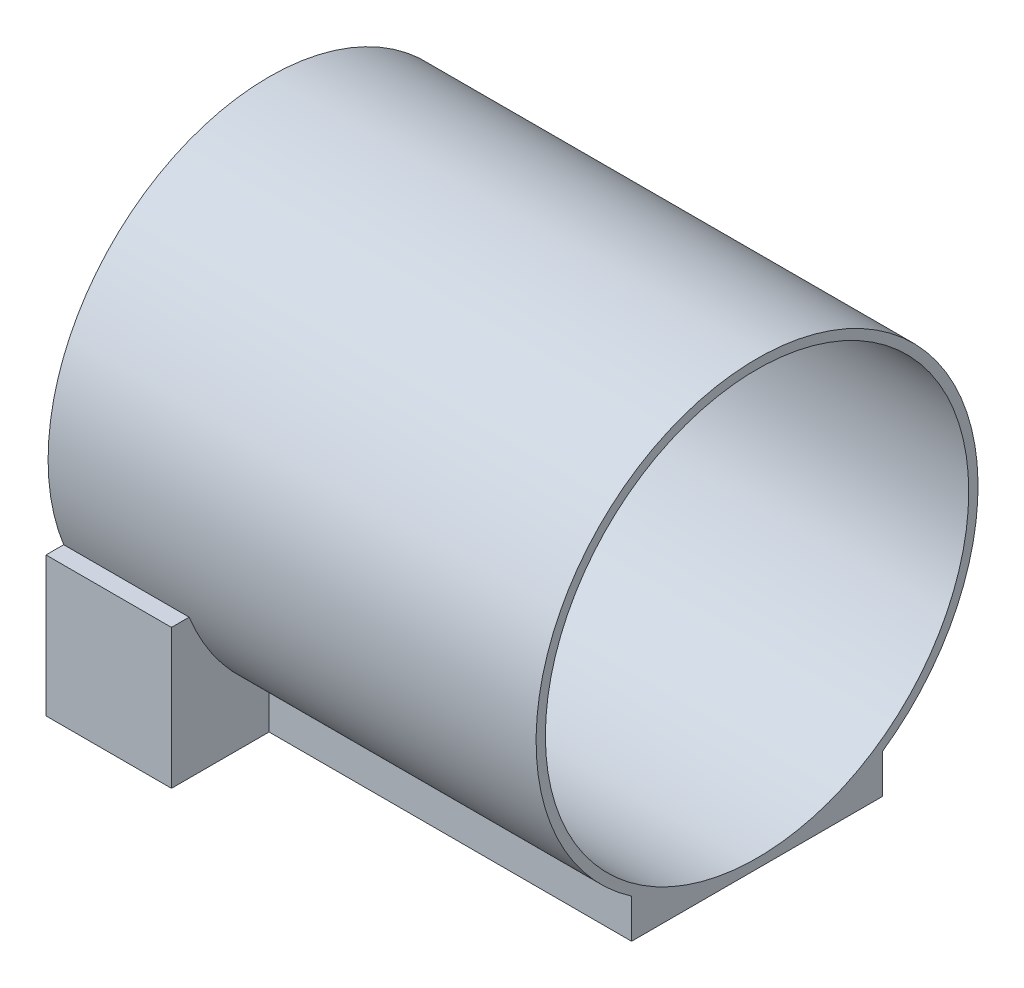
ISO-10303-21;
HEADER;
FILE_DESCRIPTION(('STEP AP214'),'2;1');
FILE_NAME('part.step','',(''),(''),'','','');
FILE_SCHEMA(('AUTOMOTIVE_DESIGN { 1 0 10303 214 1 1 1 1 }'));
ENDSEC;
DATA;
#1=APPLICATION_CONTEXT('core data for automotive mechanical design processes');
#2=APPLICATION_PROTOCOL_DEFINITION('international standard','automotive_design',2000,#1);
#3=PRODUCT_CONTEXT('',#1,'mechanical');
#4=PRODUCT('Part','Part','',(#3));
#5=PRODUCT_RELATED_PRODUCT_CATEGORY('part','',(#4));
#6=PRODUCT_DEFINITION_FORMATION('','',#4);
#7=PRODUCT_DEFINITION_CONTEXT('part definition',#1,'design');
#8=PRODUCT_DEFINITION('design','',#6,#7);
#9=PRODUCT_DEFINITION_SHAPE('','',#8);
#10=(LENGTH_UNIT() NAMED_UNIT(*) SI_UNIT(.MILLI.,.METRE.));
#11=(NAMED_UNIT(*) PLANE_ANGLE_UNIT() SI_UNIT($,.RADIAN.));
#12=(NAMED_UNIT(*) SI_UNIT($,.STERADIAN.) SOLID_ANGLE_UNIT());
#13=UNCERTAINTY_MEASURE_WITH_UNIT(LENGTH_MEASURE(1.E-05),#10,'distance_accuracy_value','');
#14=(GEOMETRIC_REPRESENTATION_CONTEXT(3) GLOBAL_UNCERTAINTY_ASSIGNED_CONTEXT((#13)) GLOBAL_UNIT_ASSIGNED_CONTEXT((#10,
#11,#12)) REPRESENTATION_CONTEXT('',''));
#15=CARTESIAN_POINT('',(0.,0.,0.));
#16=DIRECTION('',(0.,0.,1.));
#17=DIRECTION('',(1.,0.,0.));
#18=AXIS2_PLACEMENT_3D('',#15,#16,#17);
#19=CARTESIAN_POINT('',(-105.,10.,43.));
#20=DIRECTION('',(-1.,0.,0.));
#21=DIRECTION('',(0.,0.,1.));
#22=AXIS2_PLACEMENT_3D('',#19,#20,#21);
#23=PLANE('',#22);
#24=DIRECTION('',(0.,0.,-1.));
#25=VECTOR('',#24,1.);
#26=CARTESIAN_POINT('',(-105.,33.,43.));
#27=LINE('',#26,#25);
#28=CARTESIAN_POINT('',(-105.,33.,-24.5529396832897));
#29=VERTEX_POINT('',#28);
#30=CARTESIAN_POINT('',(-105.,33.,-43.));
#31=VERTEX_POINT('',#30);
#32=EDGE_CURVE('E78',#29,#31,#27,.T.);
#33=ORIENTED_EDGE('',*,*,#32,.F.);
#34=DIRECTION('',(0.,-1.,0.));
#35=VECTOR('',#34,1.);
#36=CARTESIAN_POINT('',(-105.,63.,-24.5529396832897));
#37=LINE('',#36,#35);
#38=CARTESIAN_POINT('',(-105.,42.1839257558356,-24.5529396832897));
#39=VERTEX_POINT('',#38);
#40=EDGE_CURVE('E203',#39,#29,#37,.T.);
#41=ORIENTED_EDGE('',*,*,#40,.F.);
#42=CARTESIAN_POINT('',(-105.,80.55,0.));
#43=DIRECTION('',(-1.,0.,0.));
#44=DIRECTION('',(0.,0.,1.));
#45=AXIS2_PLACEMENT_3D('',#42,#43,#44);
#46=CIRCLE('',#45,45.55);
#47=CARTESIAN_POINT('',(-105.,62.212018017427,-41.6955743071951));
#48=VERTEX_POINT('',#47);
#49=EDGE_CURVE('E171',#48,#39,#46,.T.);
#50=ORIENTED_EDGE('',*,*,#49,.F.);
#51=DIRECTION('',(0.,0.,-1.));
#52=VECTOR('',#51,1.);
#53=CARTESIAN_POINT('',(-105.,62.212018017427,-24.5529396832897));
#54=LINE('',#53,#52);
#55=CARTESIAN_POINT('',(-105.,62.212018017427,-41.8716413735209));
#56=VERTEX_POINT('',#55);
#57=EDGE_CURVE('E258',#48,#56,#54,.T.);
#58=ORIENTED_EDGE('',*,*,#57,.T.);
#59=DIRECTION('',(0.,0.99738967117498,0.0722069514206513));
#60=VECTOR('',#59,1.);
#61=CARTESIAN_POINT('',(-105.,46.6260776434145,-43.));
#62=LINE('',#61,#60);
#63=CARTESIAN_POINT('',(-105.,46.6260776434142,-43.));
#64=VERTEX_POINT('',#63);
#65=EDGE_CURVE('E178',#64,#56,#62,.T.);
#66=ORIENTED_EDGE('',*,*,#65,.F.);
#67=DIRECTION('',(0.,-1.,0.));
#68=VECTOR('',#67,1.);
#69=CARTESIAN_POINT('',(-105.,63.,-43.));
#70=LINE('',#69,#68);
#71=EDGE_CURVE('E261',#64,#31,#70,.T.);
#72=ORIENTED_EDGE('',*,*,#71,.T.);
#73=EDGE_LOOP('',(#33,#41,#50,#58,#66,#72));
#74=FACE_BOUND('',#73,.T.);
#75=ADVANCED_FACE('F67',(#74),#23,.T.);
#76=CARTESIAN_POINT('',(-115.,10.,43.));
#77=DIRECTION('',(1.,0.,0.));
#78=DIRECTION('',(0.,0.,-1.));
#79=AXIS2_PLACEMENT_3D('',#76,#77,#78);
#80=PLANE('',#79);
#81=DIRECTION('',(0.,0.,1.));
#82=VECTOR('',#81,1.);
#83=CARTESIAN_POINT('',(-115.,33.,43.));
#84=LINE('',#83,#82);
#85=CARTESIAN_POINT('',(-115.,33.,-43.));
#86=VERTEX_POINT('',#85);
#87=CARTESIAN_POINT('',(-115.,33.,-24.5529396832897));
#88=VERTEX_POINT('',#87);
#89=EDGE_CURVE('E71',#86,#88,#84,.T.);
#90=ORIENTED_EDGE('',*,*,#89,.F.);
#91=DIRECTION('',(0.,-1.,0.));
#92=VECTOR('',#91,1.);
#93=CARTESIAN_POINT('',(-115.,63.,-43.));
#94=LINE('',#93,#92);
#95=CARTESIAN_POINT('',(-115.,46.6260776434142,-43.));
#96=VERTEX_POINT('',#95);
#97=EDGE_CURVE('E195',#96,#86,#94,.T.);
#98=ORIENTED_EDGE('',*,*,#97,.F.);
#99=DIRECTION('',(0.,0.99738967117498,0.0722069514206513));
#100=VECTOR('',#99,1.);
#101=CARTESIAN_POINT('',(-115.,46.6260776434145,-43.));
#102=LINE('',#101,#100);
#103=CARTESIAN_POINT('',(-115.,62.212018017427,-41.8716413735209));
#104=VERTEX_POINT('',#103);
#105=EDGE_CURVE('E189',#96,#104,#102,.T.);
#106=ORIENTED_EDGE('',*,*,#105,.T.);
#107=DIRECTION('',(0.,0.,-1.));
#108=VECTOR('',#107,1.);
#109=CARTESIAN_POINT('',(-115.,62.212018017427,-24.5529396832897));
#110=LINE('',#109,#108);
#111=CARTESIAN_POINT('',(-115.,62.212018017427,-41.6955743071951));
#112=VERTEX_POINT('',#111);
#113=EDGE_CURVE('E187',#112,#104,#110,.T.);
#114=ORIENTED_EDGE('',*,*,#113,.F.);
#115=CARTESIAN_POINT('',(-115.,80.55,0.));
#116=DIRECTION('',(1.,0.,0.));
#117=DIRECTION('',(0.,0.,-1.));
#118=AXIS2_PLACEMENT_3D('',#115,#116,#117);
#119=CIRCLE('',#118,45.55);
#120=CARTESIAN_POINT('',(-115.,42.1839257558356,-24.5529396832897));
#121=VERTEX_POINT('',#120);
#122=EDGE_CURVE('E164',#112,#121,#119,.T.);
#123=ORIENTED_EDGE('',*,*,#122,.T.);
#124=DIRECTION('',(0.,-1.,0.));
#125=VECTOR('',#124,1.);
#126=CARTESIAN_POINT('',(-115.,63.,-24.5529396832897));
#127=LINE('',#126,#125);
#128=EDGE_CURVE('E184',#121,#88,#127,.T.);
#129=ORIENTED_EDGE('',*,*,#128,.T.);
#130=EDGE_LOOP('',(#90,#98,#106,#114,#123,#129));
#131=FACE_BOUND('',#130,.T.);
#132=ADVANCED_FACE('F183',(#131),#80,.T.);
#133=CARTESIAN_POINT('',(-105.,63.,-43.));
#134=DIRECTION('',(0.,0.,1.));
#135=DIRECTION('',(1.,0.,0.));
#136=AXIS2_PLACEMENT_3D('',#133,#134,#135);
#137=PLANE('',#136);
#138=ORIENTED_EDGE('',*,*,#71,.F.);
#139=DIRECTION('',(1.,0.,0.));
#140=VECTOR('',#139,1.);
#141=CARTESIAN_POINT('',(-125.002,46.6260776434142,-43.));
#142=LINE('',#141,#140);
#143=EDGE_CURVE('E254',#96,#64,#142,.T.);
#144=ORIENTED_EDGE('',*,*,#143,.F.);
#145=ORIENTED_EDGE('',*,*,#97,.T.);
#146=DIRECTION('',(-1.,0.,0.));
#147=VECTOR('',#146,1.);
#148=CARTESIAN_POINT('',(-115.,33.,-43.));
#149=LINE('',#148,#147);
#150=EDGE_CURVE('E12',#31,#86,#149,.T.);
#151=ORIENTED_EDGE('',*,*,#150,.F.);
#152=EDGE_LOOP('',(#138,#144,#145,#151));
#153=FACE_BOUND('',#152,.T.);
#154=ADVANCED_FACE('F338',(#153),#137,.T.);
#155=CARTESIAN_POINT('',(0.,63.,0.));
#156=DIRECTION('',(0.,-1.,0.));
#157=DIRECTION('',(0.,0.,-1.));
#158=AXIS2_PLACEMENT_3D('',#155,#156,#157);
#159=PLANE('',#158);
#160=DIRECTION('',(0.,0.,1.));
#161=VECTOR('',#160,1.);
#162=CARTESIAN_POINT('',(-120.,63.,48.));
#163=LINE('',#162,#161);
#164=CARTESIAN_POINT('',(-120.,63.,-48.));
#165=VERTEX_POINT('',#164);
#166=CARTESIAN_POINT('',(-120.,63.0000000000001,-44.1927595879687));
#167=VERTEX_POINT('',#166);
#168=EDGE_CURVE('E199',#165,#167,#163,.T.);
#169=ORIENTED_EDGE('',*,*,#168,.T.);
#170=DIRECTION('',(1.,0.,0.));
#171=VECTOR('',#170,1.);
#172=CARTESIAN_POINT('',(-120.,63.,-44.1927595879687));
#173=LINE('',#172,#171);
#174=CARTESIAN_POINT('',(-93.,63.,-44.1927595879687));
#175=VERTEX_POINT('',#174);
#176=EDGE_CURVE('E220',#167,#175,#173,.T.);
#177=ORIENTED_EDGE('',*,*,#176,.T.);
#178=DIRECTION('',(0.,0.,-1.));
#179=VECTOR('',#178,1.);
#180=CARTESIAN_POINT('',(-93.,63.,-48.));
#181=LINE('',#180,#179);
#182=CARTESIAN_POINT('',(-93.,63.,-48.));
#183=VERTEX_POINT('',#182);
#184=EDGE_CURVE('E224',#175,#183,#181,.T.);
#185=ORIENTED_EDGE('',*,*,#184,.T.);
#186=DIRECTION('',(-1.,0.,0.));
#187=VECTOR('',#186,1.);
#188=CARTESIAN_POINT('',(-120.,63.,-48.));
#189=LINE('',#188,#187);
#190=EDGE_CURVE('E319',#183,#165,#189,.T.);
#191=ORIENTED_EDGE('',*,*,#190,.T.);
#192=EDGE_LOOP('',(#169,#177,#185,#191));
#193=FACE_BOUND('',#192,.T.);
#194=ADVANCED_FACE('F384',(#193),#159,.F.);
#195=CARTESIAN_POINT('',(-115.,10.,-48.));
#196=DIRECTION('',(0.,0.,1.));
#197=DIRECTION('',(1.,0.,0.));
#198=AXIS2_PLACEMENT_3D('',#195,#196,#197);
#199=PLANE('',#198);
#200=DIRECTION('',(0.,-1.,0.));
#201=VECTOR('',#200,1.);
#202=CARTESIAN_POINT('',(-93.,33.,-48.));
#203=LINE('',#202,#201);
#204=CARTESIAN_POINT('',(-93.,33.,-48.));
#205=VERTEX_POINT('',#204);
#206=EDGE_CURVE('E287',#183,#205,#203,.T.);
#207=ORIENTED_EDGE('',*,*,#206,.T.);
#208=DIRECTION('',(-1.,0.,0.));
#209=VECTOR('',#208,1.);
#210=CARTESIAN_POINT('',(-115.,33.,-48.));
#211=LINE('',#210,#209);
#212=CARTESIAN_POINT('',(-120.,33.,-48.));
#213=VERTEX_POINT('',#212);
#214=EDGE_CURVE('E285',#205,#213,#211,.T.);
#215=ORIENTED_EDGE('',*,*,#214,.T.);
#216=DIRECTION('',(0.,-1.,0.));
#217=VECTOR('',#216,1.);
#218=CARTESIAN_POINT('',(-120.,63.,-48.));
#219=LINE('',#218,#217);
#220=EDGE_CURVE('E207',#165,#213,#219,.T.);
#221=ORIENTED_EDGE('',*,*,#220,.F.);
#222=ORIENTED_EDGE('',*,*,#190,.F.);
#223=EDGE_LOOP('',(#207,#215,#221,#222));
#224=FACE_BOUND('',#223,.T.);
#225=ADVANCED_FACE('F418',(#224),#199,.F.);
#226=CARTESIAN_POINT('',(-115.,10.,48.));
#227=DIRECTION('',(0.,0.,-1.));
#228=DIRECTION('',(-1.,0.,0.));
#229=AXIS2_PLACEMENT_3D('',#226,#227,#228);
#230=PLANE('',#229);
#231=DIRECTION('',(1.,0.,0.));
#232=VECTOR('',#231,1.);
#233=CARTESIAN_POINT('',(-93.,33.,48.));
#234=LINE('',#233,#232);
#235=CARTESIAN_POINT('',(-120.,33.,48.));
#236=VERTEX_POINT('',#235);
#237=CARTESIAN_POINT('',(-93.,33.,48.));
#238=VERTEX_POINT('',#237);
#239=EDGE_CURVE('E87',#236,#238,#234,.T.);
#240=ORIENTED_EDGE('',*,*,#239,.T.);
#241=DIRECTION('',(0.,-1.,0.));
#242=VECTOR('',#241,1.);
#243=CARTESIAN_POINT('',(-93.,33.,48.));
#244=LINE('',#243,#242);
#245=CARTESIAN_POINT('',(-93.,63.,48.));
#246=VERTEX_POINT('',#245);
#247=EDGE_CURVE('E278',#246,#238,#244,.T.);
#248=ORIENTED_EDGE('',*,*,#247,.F.);
#249=DIRECTION('',(1.,0.,0.));
#250=VECTOR('',#249,1.);
#251=CARTESIAN_POINT('',(-93.,63.,48.));
#252=LINE('',#251,#250);
#253=CARTESIAN_POINT('',(-120.,63.,48.));
#254=VERTEX_POINT('',#253);
#255=EDGE_CURVE('E249',#254,#246,#252,.T.);
#256=ORIENTED_EDGE('',*,*,#255,.F.);
#257=DIRECTION('',(0.,-1.,0.));
#258=VECTOR('',#257,1.);
#259=CARTESIAN_POINT('',(-120.,63.,48.));
#260=LINE('',#259,#258);
#261=EDGE_CURVE('E296',#254,#236,#260,.T.);
#262=ORIENTED_EDGE('',*,*,#261,.T.);
#263=EDGE_LOOP('',(#240,#248,#256,#262));
#264=FACE_BOUND('',#263,.T.);
#265=ADVANCED_FACE('F353',(#264),#230,.F.);
#266=CARTESIAN_POINT('',(-93.,33.,48.));
#267=DIRECTION('',(-1.,0.,0.));
#268=DIRECTION('',(0.,0.,1.));
#269=AXIS2_PLACEMENT_3D('',#266,#267,#268);
#270=PLANE('',#269);
#271=ORIENTED_EDGE('',*,*,#247,.T.);
#272=DIRECTION('',(0.,0.,-1.));
#273=VECTOR('',#272,1.);
#274=CARTESIAN_POINT('',(-93.,33.,48.));
#275=LINE('',#274,#273);
#276=CARTESIAN_POINT('',(-93.,33.,27.));
#277=VERTEX_POINT('',#276);
#278=EDGE_CURVE('E235',#238,#277,#275,.T.);
#279=ORIENTED_EDGE('',*,*,#278,.T.);
#280=DIRECTION('',(0.,-1.,0.));
#281=VECTOR('',#280,1.);
#282=CARTESIAN_POINT('',(-93.,33.,27.));
#283=LINE('',#282,#281);
#284=CARTESIAN_POINT('',(-93.,41.409196482443,27.));
#285=VERTEX_POINT('',#284);
#286=EDGE_CURVE('E234',#285,#277,#283,.T.);
#287=ORIENTED_EDGE('',*,*,#286,.F.);
#288=CARTESIAN_POINT('',(-93.,80.55,0.));
#289=DIRECTION('',(-1.,0.,0.));
#290=DIRECTION('',(0.,0.,1.));
#291=AXIS2_PLACEMENT_3D('',#288,#289,#290);
#292=CIRCLE('',#291,47.55);
#293=CARTESIAN_POINT('',(-93.,63.,44.1927595879687));
#294=VERTEX_POINT('',#293);
#295=EDGE_CURVE('E230',#285,#294,#292,.T.);
#296=ORIENTED_EDGE('',*,*,#295,.T.);
#297=DIRECTION('',(0.,0.,-1.));
#298=VECTOR('',#297,1.);
#299=CARTESIAN_POINT('',(-93.,63.,27.));
#300=LINE('',#299,#298);
#301=EDGE_CURVE('E218',#246,#294,#300,.T.);
#302=ORIENTED_EDGE('',*,*,#301,.F.);
#303=EDGE_LOOP('',(#271,#279,#287,#296,#302));
#304=FACE_BOUND('',#303,.T.);
#305=ADVANCED_FACE('F356',(#304),#270,.F.);
#306=CARTESIAN_POINT('',(-93.,33.,27.));
#307=DIRECTION('',(0.,0.,-1.));
#308=DIRECTION('',(-1.,0.,0.));
#309=AXIS2_PLACEMENT_3D('',#306,#307,#308);
#310=PLANE('',#309);
#311=ORIENTED_EDGE('',*,*,#286,.T.);
#312=DIRECTION('',(1.,0.,0.));
#313=VECTOR('',#312,1.);
#314=CARTESIAN_POINT('',(-93.,33.,27.));
#315=LINE('',#314,#313);
#316=CARTESIAN_POINT('',(-15.,33.,27.));
#317=VERTEX_POINT('',#316);
#318=EDGE_CURVE('E229',#277,#317,#315,.T.);
#319=ORIENTED_EDGE('',*,*,#318,.T.);
#320=DIRECTION('',(0.,-1.,0.));
#321=VECTOR('',#320,1.);
#322=CARTESIAN_POINT('',(-15.,63.,27.));
#323=LINE('',#322,#321);
#324=CARTESIAN_POINT('',(-15.,41.409196482443,27.));
#325=VERTEX_POINT('',#324);
#326=EDGE_CURVE('E248',#325,#317,#323,.T.);
#327=ORIENTED_EDGE('',*,*,#326,.F.);
#328=DIRECTION('',(1.,0.,0.));
#329=VECTOR('',#328,1.);
#330=CARTESIAN_POINT('',(-120.,41.409196482443,27.));
#331=LINE('',#330,#329);
#332=EDGE_CURVE('E225',#325,#285,#331,.F.);
#333=ORIENTED_EDGE('',*,*,#332,.T.);
#334=EDGE_LOOP('',(#311,#319,#327,#333));
#335=FACE_BOUND('',#334,.T.);
#336=ADVANCED_FACE('F359',(#335),#310,.F.);
#337=CARTESIAN_POINT('',(-93.,33.,-27.));
#338=DIRECTION('',(0.,0.,1.));
#339=DIRECTION('',(1.,0.,0.));
#340=AXIS2_PLACEMENT_3D('',#337,#338,#339);
#341=PLANE('',#340);
#342=DIRECTION('',(-1.,0.,0.));
#343=VECTOR('',#342,1.);
#344=CARTESIAN_POINT('',(-93.,33.,-27.));
#345=LINE('',#344,#343);
#346=CARTESIAN_POINT('',(-15.,33.,-27.));
#347=VERTEX_POINT('',#346);
#348=CARTESIAN_POINT('',(-93.,33.,-27.));
#349=VERTEX_POINT('',#348);
#350=EDGE_CURVE('E213',#347,#349,#345,.T.);
#351=ORIENTED_EDGE('',*,*,#350,.T.);
#352=DIRECTION('',(0.,-1.,0.));
#353=VECTOR('',#352,1.);
#354=CARTESIAN_POINT('',(-93.,33.,-27.));
#355=LINE('',#354,#353);
#356=CARTESIAN_POINT('',(-93.,41.409196482443,-27.));
#357=VERTEX_POINT('',#356);
#358=EDGE_CURVE('E284',#357,#349,#355,.T.);
#359=ORIENTED_EDGE('',*,*,#358,.F.);
#360=DIRECTION('',(1.,0.,0.));
#361=VECTOR('',#360,1.);
#362=CARTESIAN_POINT('',(-120.,41.409196482443,-27.));
#363=LINE('',#362,#361);
#364=CARTESIAN_POINT('',(-15.,41.409196482443,-27.));
#365=VERTEX_POINT('',#364);
#366=EDGE_CURVE('E208',#357,#365,#363,.T.);
#367=ORIENTED_EDGE('',*,*,#366,.T.);
#368=DIRECTION('',(0.,-1.,0.));
#369=VECTOR('',#368,1.);
#370=CARTESIAN_POINT('',(-15.,63.,-27.));
#371=LINE('',#370,#369);
#372=EDGE_CURVE('E212',#365,#347,#371,.T.);
#373=ORIENTED_EDGE('',*,*,#372,.T.);
#374=EDGE_LOOP('',(#351,#359,#367,#373));
#375=FACE_BOUND('',#374,.T.);
#376=ADVANCED_FACE('F363',(#375),#341,.F.);
#377=CARTESIAN_POINT('',(-93.,33.,-48.));
#378=DIRECTION('',(-1.,0.,0.));
#379=DIRECTION('',(0.,0.,1.));
#380=AXIS2_PLACEMENT_3D('',#377,#378,#379);
#381=PLANE('',#380);
#382=ORIENTED_EDGE('',*,*,#358,.T.);
#383=DIRECTION('',(0.,0.,-1.));
#384=VECTOR('',#383,1.);
#385=CARTESIAN_POINT('',(-93.,33.,-48.));
#386=LINE('',#385,#384);
#387=EDGE_CURVE('E219',#349,#205,#386,.T.);
#388=ORIENTED_EDGE('',*,*,#387,.T.);
#389=ORIENTED_EDGE('',*,*,#206,.F.);
#390=ORIENTED_EDGE('',*,*,#184,.F.);
#391=CARTESIAN_POINT('',(-93.,80.55,0.));
#392=DIRECTION('',(-1.,0.,0.));
#393=DIRECTION('',(0.,0.,1.));
#394=AXIS2_PLACEMENT_3D('',#391,#392,#393);
#395=CIRCLE('',#394,47.55);
#396=EDGE_CURVE('E214',#175,#357,#395,.T.);
#397=ORIENTED_EDGE('',*,*,#396,.T.);
#398=EDGE_LOOP('',(#382,#388,#389,#390,#397));
#399=FACE_BOUND('',#398,.T.);
#400=ADVANCED_FACE('F367',(#399),#381,.F.);
#401=ORIENTED_EDGE('',*,*,#301,.T.);
#402=DIRECTION('',(1.,0.,0.));
#403=VECTOR('',#402,1.);
#404=CARTESIAN_POINT('',(-120.,63.,44.1927595879687));
#405=LINE('',#404,#403);
#406=CARTESIAN_POINT('',(-120.,63.0000000000001,44.1927595879687));
#407=VERTEX_POINT('',#406);
#408=EDGE_CURVE('E236',#294,#407,#405,.F.);
#409=ORIENTED_EDGE('',*,*,#408,.T.);
#410=EDGE_CURVE('E240',#407,#254,#163,.T.);
#411=ORIENTED_EDGE('',*,*,#410,.T.);
#412=ORIENTED_EDGE('',*,*,#255,.T.);
#413=EDGE_LOOP('',(#401,#409,#411,#412));
#414=FACE_BOUND('',#413,.T.);
#415=ADVANCED_FACE('F371',(#414),#159,.F.);
#416=CARTESIAN_POINT('',(-15.,63.,-27.));
#417=DIRECTION('',(-1.,0.,0.));
#418=DIRECTION('',(0.,0.,1.));
#419=AXIS2_PLACEMENT_3D('',#416,#417,#418);
#420=PLANE('',#419);
#421=CARTESIAN_POINT('',(-15.,80.55,0.));
#422=DIRECTION('',(1.,0.,0.));
#423=DIRECTION('',(0.,0.,-1.));
#424=AXIS2_PLACEMENT_3D('',#421,#422,#423);
#425=CIRCLE('',#424,45.55);
#426=CARTESIAN_POINT('',(-15.,80.55,-45.55));
#427=VERTEX_POINT('',#426);
#428=EDGE_CURVE('E271',#427,#427,#425,.T.);
#429=ORIENTED_EDGE('',*,*,#428,.F.);
#430=EDGE_LOOP('',(#429));
#431=FACE_BOUND('',#430,.T.);
#432=CARTESIAN_POINT('',(-15.,80.55,0.));
#433=DIRECTION('',(1.,0.,0.));
#434=DIRECTION('',(0.,0.,-1.));
#435=AXIS2_PLACEMENT_3D('',#432,#433,#434);
#436=CIRCLE('',#435,47.55);
#437=EDGE_CURVE('E244',#365,#325,#436,.T.);
#438=ORIENTED_EDGE('',*,*,#437,.T.);
#439=ORIENTED_EDGE('',*,*,#326,.T.);
#440=DIRECTION('',(0.,0.,-1.));
#441=VECTOR('',#440,1.);
#442=CARTESIAN_POINT('',(-15.,33.,-27.));
#443=LINE('',#442,#441);
#444=EDGE_CURVE('E302',#317,#347,#443,.T.);
#445=ORIENTED_EDGE('',*,*,#444,.T.);
#446=ORIENTED_EDGE('',*,*,#372,.F.);
#447=EDGE_LOOP('',(#438,#439,#445,#446));
#448=FACE_BOUND('',#447,.T.);
#449=ADVANCED_FACE('F373',(#431,#448),#420,.F.);
#450=CARTESIAN_POINT('',(-120.,63.,0.));
#451=DIRECTION('',(1.,0.,0.));
#452=DIRECTION('',(0.,0.,-1.));
#453=AXIS2_PLACEMENT_3D('',#450,#451,#452);
#454=PLANE('',#453);
#455=DIRECTION('',(0.,0.,1.));
#456=VECTOR('',#455,1.);
#457=CARTESIAN_POINT('',(-120.,33.,0.));
#458=LINE('',#457,#456);
#459=EDGE_CURVE('E309',#213,#236,#458,.T.);
#460=ORIENTED_EDGE('',*,*,#459,.T.);
#461=ORIENTED_EDGE('',*,*,#261,.F.);
#462=ORIENTED_EDGE('',*,*,#410,.F.);
#463=CARTESIAN_POINT('',(-120.,80.55,0.));
#464=DIRECTION('',(1.,0.,0.));
#465=DIRECTION('',(0.,0.,-1.));
#466=AXIS2_PLACEMENT_3D('',#463,#464,#465);
#467=CIRCLE('',#466,47.55);
#468=EDGE_CURVE('E206',#167,#407,#467,.T.);
#469=ORIENTED_EDGE('',*,*,#468,.F.);
#470=ORIENTED_EDGE('',*,*,#168,.F.);
#471=ORIENTED_EDGE('',*,*,#220,.T.);
#472=EDGE_LOOP('',(#460,#461,#462,#469,#470,#471));
#473=FACE_BOUND('',#472,.T.);
#474=ADVANCED_FACE('F376',(#473),#454,.F.);
#475=CARTESIAN_POINT('',(-115.,63.,-24.5529396832897));
#476=DIRECTION('',(0.,0.,-1.));
#477=DIRECTION('',(-1.,0.,0.));
#478=AXIS2_PLACEMENT_3D('',#475,#476,#477);
#479=PLANE('',#478);
#480=DIRECTION('',(1.,0.,0.));
#481=VECTOR('',#480,1.);
#482=CARTESIAN_POINT('',(-115.,42.1839257558356,-24.5529396832897));
#483=LINE('',#482,#481);
#484=EDGE_CURVE('E167',#39,#121,#483,.F.);
#485=ORIENTED_EDGE('',*,*,#484,.F.);
#486=ORIENTED_EDGE('',*,*,#40,.T.);
#487=DIRECTION('',(1.,0.,0.));
#488=VECTOR('',#487,1.);
#489=CARTESIAN_POINT('',(-125.002,33.,-24.5529396832897));
#490=LINE('',#489,#488);
#491=EDGE_CURVE('E193',#88,#29,#490,.T.);
#492=ORIENTED_EDGE('',*,*,#491,.F.);
#493=ORIENTED_EDGE('',*,*,#128,.F.);
#494=EDGE_LOOP('',(#485,#486,#492,#493));
#495=FACE_BOUND('',#494,.T.);
#496=ADVANCED_FACE('F191',(#495),#479,.T.);
#497=CARTESIAN_POINT('',(-120.,80.55,0.));
#498=DIRECTION('',(1.,0.,0.));
#499=DIRECTION('',(0.,0.,-1.));
#500=AXIS2_PLACEMENT_3D('',#497,#498,#499);
#501=CYLINDRICAL_SURFACE('',#500,47.55);
#502=ORIENTED_EDGE('',*,*,#366,.F.);
#503=ORIENTED_EDGE('',*,*,#396,.F.);
#504=ORIENTED_EDGE('',*,*,#176,.F.);
#505=ORIENTED_EDGE('',*,*,#468,.T.);
#506=ORIENTED_EDGE('',*,*,#408,.F.);
#507=ORIENTED_EDGE('',*,*,#295,.F.);
#508=ORIENTED_EDGE('',*,*,#332,.F.);
#509=ORIENTED_EDGE('',*,*,#437,.F.);
#510=EDGE_LOOP('',(#502,#503,#504,#505,#506,#507,#508,#509));
#511=FACE_BOUND('',#510,.T.);
#512=ADVANCED_FACE('F389',(#511),#501,.T.);
#513=CARTESIAN_POINT('',(-115.,62.212018017427,-24.5529396832897));
#514=DIRECTION('',(0.,-1.,0.));
#515=DIRECTION('',(0.,0.,-1.));
#516=AXIS2_PLACEMENT_3D('',#513,#514,#515);
#517=PLANE('',#516);
#518=DIRECTION('',(1.,0.,0.));
#519=VECTOR('',#518,1.);
#520=CARTESIAN_POINT('',(-115.,62.212018017427,-41.6955743071951));
#521=LINE('',#520,#519);
#522=EDGE_CURVE('E177',#112,#48,#521,.T.);
#523=ORIENTED_EDGE('',*,*,#522,.F.);
#524=ORIENTED_EDGE('',*,*,#113,.T.);
#525=DIRECTION('',(1.,0.,0.));
#526=VECTOR('',#525,1.);
#527=CARTESIAN_POINT('',(-115.,62.212018017427,-41.8716413735209));
#528=LINE('',#527,#526);
#529=EDGE_CURVE('E250',#104,#56,#528,.T.);
#530=ORIENTED_EDGE('',*,*,#529,.T.);
#531=ORIENTED_EDGE('',*,*,#57,.F.);
#532=EDGE_LOOP('',(#523,#524,#530,#531));
#533=FACE_BOUND('',#532,.T.);
#534=ADVANCED_FACE('F392',(#533),#517,.T.);
#535=CARTESIAN_POINT('',(-115.,46.6260776434145,-43.));
#536=DIRECTION('',(0.,0.0722069514206513,-0.99738967117498));
#537=DIRECTION('',(0.,0.99738967117498,0.0722069514206513));
#538=AXIS2_PLACEMENT_3D('',#535,#536,#537);
#539=PLANE('',#538);
#540=ORIENTED_EDGE('',*,*,#105,.F.);
#541=ORIENTED_EDGE('',*,*,#143,.T.);
#542=ORIENTED_EDGE('',*,*,#65,.T.);
#543=ORIENTED_EDGE('',*,*,#529,.F.);
#544=EDGE_LOOP('',(#540,#541,#542,#543));
#545=FACE_BOUND('',#544,.T.);
#546=ADVANCED_FACE('F345',(#545),#539,.F.);
#547=CARTESIAN_POINT('',(-115.,80.55,0.));
#548=DIRECTION('',(1.,0.,0.));
#549=DIRECTION('',(0.,0.,-1.));
#550=AXIS2_PLACEMENT_3D('',#547,#548,#549);
#551=CYLINDRICAL_SURFACE('',#550,45.55);
#552=ORIENTED_EDGE('',*,*,#484,.T.);
#553=ORIENTED_EDGE('',*,*,#122,.F.);
#554=ORIENTED_EDGE('',*,*,#522,.T.);
#555=ORIENTED_EDGE('',*,*,#49,.T.);
#556=EDGE_LOOP('',(#552,#553,#554,#555));
#557=FACE_BOUND('',#556,.T.);
#558=ORIENTED_EDGE('',*,*,#428,.T.);
#559=EDGE_LOOP('',(#558));
#560=FACE_BOUND('',#559,.T.);
#561=ADVANCED_FACE('F168',(#557,#560),#551,.F.);
#562=CARTESIAN_POINT('',(-125.,33.,-75.));
#563=DIRECTION('',(0.,1.,0.));
#564=DIRECTION('',(0.,0.,1.));
#565=AXIS2_PLACEMENT_3D('',#562,#563,#564);
#566=PLANE('',#565);
#567=ORIENTED_EDGE('',*,*,#89,.T.);
#568=ORIENTED_EDGE('',*,*,#491,.T.);
#569=ORIENTED_EDGE('',*,*,#32,.T.);
#570=ORIENTED_EDGE('',*,*,#150,.T.);
#571=EDGE_LOOP('',(#567,#568,#569,#570));
#572=FACE_BOUND('',#571,.T.);
#573=ORIENTED_EDGE('',*,*,#239,.F.);
#574=ORIENTED_EDGE('',*,*,#459,.F.);
#575=ORIENTED_EDGE('',*,*,#214,.F.);
#576=ORIENTED_EDGE('',*,*,#387,.F.);
#577=ORIENTED_EDGE('',*,*,#350,.F.);
#578=ORIENTED_EDGE('',*,*,#444,.F.);
#579=ORIENTED_EDGE('',*,*,#318,.F.);
#580=ORIENTED_EDGE('',*,*,#278,.F.);
#581=EDGE_LOOP('',(#573,#574,#575,#576,#577,#578,#579,#580));
#582=FACE_BOUND('',#581,.T.);
#583=ADVANCED_FACE('F69',(#572,#582),#566,.F.);
#584=CLOSED_SHELL('',(#75,#132,#154,#194,#225,#265,#305,#336,#376,#400,#415,#449,#474,#496,#512,
#534,#546,#561,#583));
#585=MANIFOLD_SOLID_BREP('B2',#584);
#586=ADVANCED_BREP_SHAPE_REPRESENTATION('',(#18,#585),#14);
#587=SHAPE_DEFINITION_REPRESENTATION(#9,#586);
ENDSEC;
END-ISO-10303-21;
